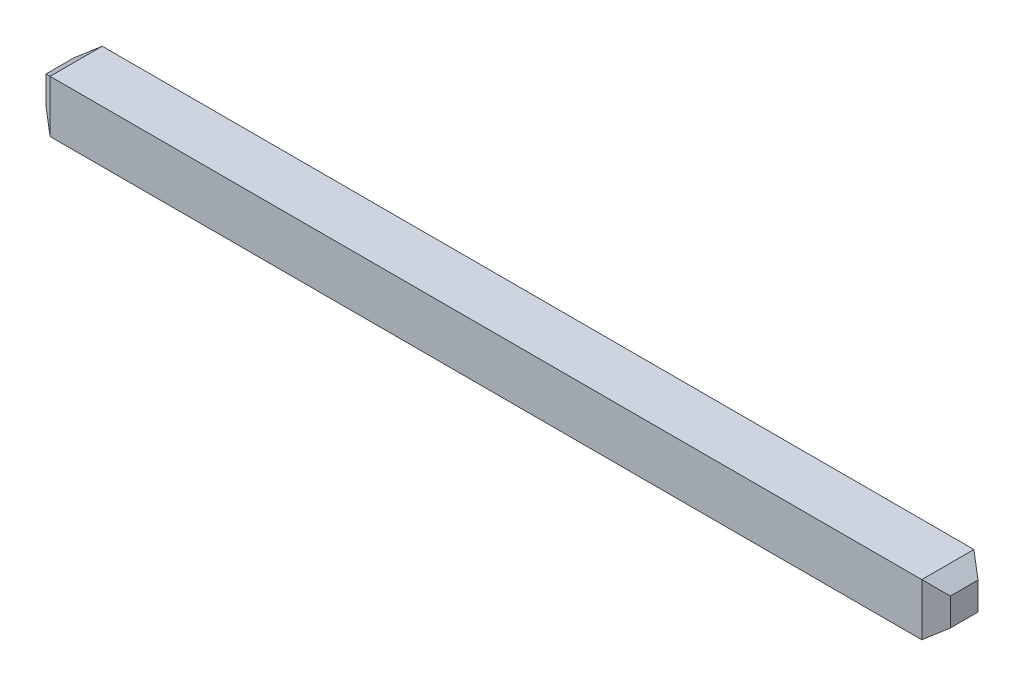
ISO-10303-21;
HEADER;
FILE_DESCRIPTION(('STEP AP214'),'2;1');
FILE_NAME('part.step','',(''),(''),'','','');
FILE_SCHEMA(('AUTOMOTIVE_DESIGN { 1 0 10303 214 1 1 1 1 }'));
ENDSEC;
DATA;
#1=APPLICATION_CONTEXT('core data for automotive mechanical design processes');
#2=APPLICATION_PROTOCOL_DEFINITION('international standard','automotive_design',2000,#1);
#3=PRODUCT_CONTEXT('',#1,'mechanical');
#4=PRODUCT('Part','Part','',(#3));
#5=PRODUCT_RELATED_PRODUCT_CATEGORY('part','',(#4));
#6=PRODUCT_DEFINITION_FORMATION('','',#4);
#7=PRODUCT_DEFINITION_CONTEXT('part definition',#1,'design');
#8=PRODUCT_DEFINITION('design','',#6,#7);
#9=PRODUCT_DEFINITION_SHAPE('','',#8);
#10=(LENGTH_UNIT() NAMED_UNIT(*) SI_UNIT(.MILLI.,.METRE.));
#11=(NAMED_UNIT(*) PLANE_ANGLE_UNIT() SI_UNIT($,.RADIAN.));
#12=(NAMED_UNIT(*) SI_UNIT($,.STERADIAN.) SOLID_ANGLE_UNIT());
#13=UNCERTAINTY_MEASURE_WITH_UNIT(LENGTH_MEASURE(1.E-05),#10,'distance_accuracy_value','');
#14=(GEOMETRIC_REPRESENTATION_CONTEXT(3) GLOBAL_UNCERTAINTY_ASSIGNED_CONTEXT((#13)) GLOBAL_UNIT_ASSIGNED_CONTEXT((#10,
#11,#12)) REPRESENTATION_CONTEXT('',''));
#15=CARTESIAN_POINT('',(0.,0.,0.));
#16=DIRECTION('',(0.,0.,1.));
#17=DIRECTION('',(1.,0.,0.));
#18=AXIS2_PLACEMENT_3D('',#15,#16,#17);
#19=CARTESIAN_POINT('',(-2.4,1.23,-11.675));
#20=DIRECTION('',(0.599999999990736,0.,0.800000000006948));
#21=DIRECTION('',(0.800000000006948,0.,-0.599999999990736));
#22=AXIS2_PLACEMENT_3D('',#19,#20,#21);
#23=PLANE('',#22);
#24=DIRECTION('',(0.,1.,0.));
#25=VECTOR('',#24,1.);
#26=CARTESIAN_POINT('',(-2.3,1.23,-11.75));
#27=LINE('',#26,#25);
#28=CARTESIAN_POINT('',(-2.29999999999957,1.55,-11.7499999999994));
#29=VERTEX_POINT('',#28);
#30=CARTESIAN_POINT('',(-2.29999999999958,0.909999999999898,-11.7499999999994));
#31=VERTEX_POINT('',#30);
#32=EDGE_CURVE('E101',#29,#31,#27,.F.);
#33=ORIENTED_EDGE('',*,*,#32,.T.);
#34=DIRECTION('',(-0.685994340569491,0.51449575542834,0.514495755427438));
#35=VECTOR('',#34,1.);
#36=CARTESIAN_POINT('',(-2.30000000000009,0.909999999999786,-11.75));
#37=LINE('',#36,#35);
#38=CARTESIAN_POINT('',(-2.50000000000021,1.06000000000001,-11.6000000000003));
#39=VERTEX_POINT('',#38);
#40=EDGE_CURVE('E85',#31,#39,#37,.T.);
#41=ORIENTED_EDGE('',*,*,#40,.T.);
#42=DIRECTION('',(0.,1.,0.));
#43=VECTOR('',#42,1.);
#44=CARTESIAN_POINT('',(-2.5,1.23,-11.6));
#45=LINE('',#44,#43);
#46=CARTESIAN_POINT('',(-2.50000000000044,1.4,-11.6000000000006));
#47=VERTEX_POINT('',#46);
#48=EDGE_CURVE('E79',#39,#47,#45,.T.);
#49=ORIENTED_EDGE('',*,*,#48,.T.);
#50=DIRECTION('',(-0.685994340570034,-0.514495755427526,0.514495755427528));
#51=VECTOR('',#50,1.);
#52=CARTESIAN_POINT('',(-2.3,1.55,-11.75));
#53=LINE('',#52,#51);
#54=EDGE_CURVE('E20',#29,#47,#53,.T.);
#55=ORIENTED_EDGE('',*,*,#54,.F.);
#56=EDGE_LOOP('',(#33,#41,#49,#55));
#57=FACE_BOUND('',#56,.T.);
#58=ADVANCED_FACE('F17',(#57),#23,.F.);
#59=CARTESIAN_POINT('',(8.5,1.23,-11.675));
#60=DIRECTION('',(-0.599999999990736,0.,0.800000000006948));
#61=DIRECTION('',(0.800000000006948,0.,0.599999999990736));
#62=AXIS2_PLACEMENT_3D('',#59,#60,#61);
#63=PLANE('',#62);
#64=DIRECTION('',(0.,1.,0.));
#65=VECTOR('',#64,1.);
#66=CARTESIAN_POINT('',(8.6,1.23,-11.6));
#67=LINE('',#66,#65);
#68=CARTESIAN_POINT('',(8.6000000000002,1.06000000000003,-11.6000000000003));
#69=VERTEX_POINT('',#68);
#70=CARTESIAN_POINT('',(8.60000000000043,1.4,-11.6000000000006));
#71=VERTEX_POINT('',#70);
#72=EDGE_CURVE('E113',#69,#71,#67,.T.);
#73=ORIENTED_EDGE('',*,*,#72,.F.);
#74=DIRECTION('',(-0.685994340569492,-0.51449575542834,-0.514495755427437));
#75=VECTOR('',#74,1.);
#76=CARTESIAN_POINT('',(8.59999999999996,1.06000000000005,-11.6));
#77=LINE('',#76,#75);
#78=CARTESIAN_POINT('',(8.39999999999959,0.909999999999884,-11.7499999999994));
#79=VERTEX_POINT('',#78);
#80=EDGE_CURVE('E108',#69,#79,#77,.T.);
#81=ORIENTED_EDGE('',*,*,#80,.T.);
#82=DIRECTION('',(0.,1.,0.));
#83=VECTOR('',#82,1.);
#84=CARTESIAN_POINT('',(8.4,1.23,-11.75));
#85=LINE('',#84,#83);
#86=CARTESIAN_POINT('',(8.39999999999957,1.55,-11.7499999999994));
#87=VERTEX_POINT('',#86);
#88=EDGE_CURVE('E99',#79,#87,#85,.T.);
#89=ORIENTED_EDGE('',*,*,#88,.T.);
#90=DIRECTION('',(-0.685994340570033,0.514495755427525,-0.514495755427531));
#91=VECTOR('',#90,1.);
#92=CARTESIAN_POINT('',(8.6,1.4,-11.6));
#93=LINE('',#92,#91);
#94=EDGE_CURVE('E116',#71,#87,#93,.T.);
#95=ORIENTED_EDGE('',*,*,#94,.F.);
#96=EDGE_LOOP('',(#73,#81,#89,#95));
#97=FACE_BOUND('',#96,.T.);
#98=ADVANCED_FACE('F214',(#97),#63,.F.);
#99=CARTESIAN_POINT('',(-2.4,1.475,-11.43));
#100=DIRECTION('',(-0.6,0.8,0.));
#101=DIRECTION('',(-0.8,-0.6,0.));
#102=AXIS2_PLACEMENT_3D('',#99,#100,#101);
#103=PLANE('',#102);
#104=DIRECTION('',(-0.685994340575993,-0.514495755427528,-0.514495755419581));
#105=VECTOR('',#104,1.);
#106=CARTESIAN_POINT('',(-2.29999999999913,1.55,-11.1100000000012));
#107=LINE('',#106,#105);
#108=CARTESIAN_POINT('',(-2.29999999999989,1.55,-11.1100000000001));
#109=VERTEX_POINT('',#108);
#110=CARTESIAN_POINT('',(-2.50000000000022,1.4,-11.2599999999997));
#111=VERTEX_POINT('',#110);
#112=EDGE_CURVE('E128',#109,#111,#107,.T.);
#113=ORIENTED_EDGE('',*,*,#112,.F.);
#114=DIRECTION('',(0.,0.,1.));
#115=VECTOR('',#114,1.);
#116=CARTESIAN_POINT('',(-2.3,1.55,-11.43));
#117=LINE('',#116,#115);
#118=EDGE_CURVE('E93',#29,#109,#117,.T.);
#119=ORIENTED_EDGE('',*,*,#118,.F.);
#120=ORIENTED_EDGE('',*,*,#54,.T.);
#121=DIRECTION('',(0.,0.,-1.));
#122=VECTOR('',#121,1.);
#123=CARTESIAN_POINT('',(-2.5,1.4,-11.43));
#124=LINE('',#123,#122);
#125=EDGE_CURVE('E87',#47,#111,#124,.F.);
#126=ORIENTED_EDGE('',*,*,#125,.T.);
#127=EDGE_LOOP('',(#113,#119,#120,#126));
#128=FACE_BOUND('',#127,.T.);
#129=ADVANCED_FACE('F90',(#128),#103,.T.);
#130=CARTESIAN_POINT('',(-2.5,1.23,-11.43));
#131=DIRECTION('',(1.,0.,0.));
#132=DIRECTION('',(0.,0.,-1.));
#133=AXIS2_PLACEMENT_3D('',#130,#131,#132);
#134=PLANE('',#133);
#135=DIRECTION('',(0.,1.,0.));
#136=VECTOR('',#135,1.);
#137=CARTESIAN_POINT('',(-2.50000000000087,1.23,-11.2599999999988));
#138=LINE('',#137,#136);
#139=CARTESIAN_POINT('',(-2.50000000000021,1.06000000000001,-11.2599999999997));
#140=VERTEX_POINT('',#139);
#141=EDGE_CURVE('E97',#111,#140,#138,.F.);
#142=ORIENTED_EDGE('',*,*,#141,.F.);
#143=ORIENTED_EDGE('',*,*,#125,.F.);
#144=ORIENTED_EDGE('',*,*,#48,.F.);
#145=DIRECTION('',(0.,0.,1.));
#146=VECTOR('',#145,1.);
#147=CARTESIAN_POINT('',(-2.49999999999996,1.06000000000005,-11.43));
#148=LINE('',#147,#146);
#149=EDGE_CURVE('E105',#39,#140,#148,.T.);
#150=ORIENTED_EDGE('',*,*,#149,.T.);
#151=EDGE_LOOP('',(#142,#143,#144,#150));
#152=FACE_BOUND('',#151,.T.);
#153=ADVANCED_FACE('F95',(#152),#134,.F.);
#154=CARTESIAN_POINT('',(3.05,1.23,-11.75));
#155=DIRECTION('',(0.,0.,1.));
#156=DIRECTION('',(1.,0.,0.));
#157=AXIS2_PLACEMENT_3D('',#154,#155,#156);
#158=PLANE('',#157);
#159=ORIENTED_EDGE('',*,*,#32,.F.);
#160=DIRECTION('',(1.,0.,0.));
#161=VECTOR('',#160,1.);
#162=CARTESIAN_POINT('',(3.05,1.55,-11.75));
#163=LINE('',#162,#161);
#164=EDGE_CURVE('E122',#87,#29,#163,.F.);
#165=ORIENTED_EDGE('',*,*,#164,.F.);
#166=ORIENTED_EDGE('',*,*,#88,.F.);
#167=DIRECTION('',(1.,0.,0.));
#168=VECTOR('',#167,1.);
#169=CARTESIAN_POINT('',(3.05,0.91,-11.75));
#170=LINE('',#169,#168);
#171=EDGE_CURVE('E136',#79,#31,#170,.F.);
#172=ORIENTED_EDGE('',*,*,#171,.T.);
#173=EDGE_LOOP('',(#159,#165,#166,#172));
#174=FACE_BOUND('',#173,.T.);
#175=ADVANCED_FACE('F182',(#174),#158,.F.);
#176=CARTESIAN_POINT('',(-2.4,0.9849999999999,-11.43));
#177=DIRECTION('',(0.600000000000912,0.799999999999316,0.));
#178=DIRECTION('',(-0.799999999999316,0.600000000000912,0.));
#179=AXIS2_PLACEMENT_3D('',#176,#177,#178);
#180=PLANE('',#179);
#181=DIRECTION('',(0.,0.,1.));
#182=VECTOR('',#181,1.);
#183=CARTESIAN_POINT('',(-2.3,0.91,-11.43));
#184=LINE('',#183,#182);
#185=CARTESIAN_POINT('',(-2.29999999999983,0.909999999999856,-11.1100000000003));
#186=VERTEX_POINT('',#185);
#187=EDGE_CURVE('E139',#31,#186,#184,.T.);
#188=ORIENTED_EDGE('',*,*,#187,.T.);
#189=DIRECTION('',(0.685994340575872,-0.514495755427781,0.51449575541949));
#190=VECTOR('',#189,1.);
#191=CARTESIAN_POINT('',(-2.50000000000087,1.06,-11.2599999999988));
#192=LINE('',#191,#190);
#193=EDGE_CURVE('E131',#140,#186,#192,.T.);
#194=ORIENTED_EDGE('',*,*,#193,.F.);
#195=ORIENTED_EDGE('',*,*,#149,.F.);
#196=ORIENTED_EDGE('',*,*,#40,.F.);
#197=EDGE_LOOP('',(#188,#194,#195,#196));
#198=FACE_BOUND('',#197,.T.);
#199=ADVANCED_FACE('F179',(#198),#180,.F.);
#200=CARTESIAN_POINT('',(8.5,0.9849999999999,-11.43));
#201=DIRECTION('',(-0.600000000000912,0.799999999999316,0.));
#202=DIRECTION('',(-0.799999999999316,-0.600000000000912,0.));
#203=AXIS2_PLACEMENT_3D('',#200,#201,#202);
#204=PLANE('',#203);
#205=DIRECTION('',(0.,0.,-1.));
#206=VECTOR('',#205,1.);
#207=CARTESIAN_POINT('',(8.6,1.06,-11.43));
#208=LINE('',#207,#206);
#209=CARTESIAN_POINT('',(8.6000000000002,1.06000000000003,-11.2599999999997));
#210=VERTEX_POINT('',#209);
#211=EDGE_CURVE('E110',#210,#69,#208,.T.);
#212=ORIENTED_EDGE('',*,*,#211,.F.);
#213=DIRECTION('',(0.68599434057587,0.514495755427782,-0.514495755419492));
#214=VECTOR('',#213,1.);
#215=CARTESIAN_POINT('',(8.39999999999913,0.9099999999999,-11.1100000000012));
#216=LINE('',#215,#214);
#217=CARTESIAN_POINT('',(8.39999999999993,0.909999999999868,-11.1100000000001));
#218=VERTEX_POINT('',#217);
#219=EDGE_CURVE('E35',#218,#210,#216,.T.);
#220=ORIENTED_EDGE('',*,*,#219,.F.);
#221=DIRECTION('',(0.,0.,1.));
#222=VECTOR('',#221,1.);
#223=CARTESIAN_POINT('',(8.4,0.91,-11.43));
#224=LINE('',#223,#222);
#225=EDGE_CURVE('E134',#218,#79,#224,.F.);
#226=ORIENTED_EDGE('',*,*,#225,.T.);
#227=ORIENTED_EDGE('',*,*,#80,.F.);
#228=EDGE_LOOP('',(#212,#220,#226,#227));
#229=FACE_BOUND('',#228,.T.);
#230=ADVANCED_FACE('F181',(#229),#204,.F.);
#231=CARTESIAN_POINT('',(8.6,1.23,-11.43));
#232=DIRECTION('',(1.,0.,0.));
#233=DIRECTION('',(0.,0.,-1.));
#234=AXIS2_PLACEMENT_3D('',#231,#232,#233);
#235=PLANE('',#234);
#236=ORIENTED_EDGE('',*,*,#72,.T.);
#237=DIRECTION('',(0.,0.,1.));
#238=VECTOR('',#237,1.);
#239=CARTESIAN_POINT('',(8.6,1.4,-11.43));
#240=LINE('',#239,#238);
#241=CARTESIAN_POINT('',(8.60000000000022,1.4,-11.2599999999997));
#242=VERTEX_POINT('',#241);
#243=EDGE_CURVE('E119',#242,#71,#240,.F.);
#244=ORIENTED_EDGE('',*,*,#243,.F.);
#245=DIRECTION('',(0.,1.,0.));
#246=VECTOR('',#245,1.);
#247=CARTESIAN_POINT('',(8.60000000000087,1.23,-11.2599999999988));
#248=LINE('',#247,#246);
#249=EDGE_CURVE('E142',#210,#242,#248,.T.);
#250=ORIENTED_EDGE('',*,*,#249,.F.);
#251=ORIENTED_EDGE('',*,*,#211,.T.);
#252=EDGE_LOOP('',(#236,#244,#250,#251));
#253=FACE_BOUND('',#252,.T.);
#254=ADVANCED_FACE('F189',(#253),#235,.T.);
#255=CARTESIAN_POINT('',(8.5,1.475,-11.43));
#256=DIRECTION('',(0.6,0.8,0.));
#257=DIRECTION('',(-0.8,0.6,0.));
#258=AXIS2_PLACEMENT_3D('',#255,#256,#257);
#259=PLANE('',#258);
#260=DIRECTION('',(-0.685994340575991,0.51449575542753,0.514495755419583));
#261=VECTOR('',#260,1.);
#262=CARTESIAN_POINT('',(8.60000000000087,1.4,-11.2599999999988));
#263=LINE('',#262,#261);
#264=CARTESIAN_POINT('',(8.39999999999989,1.55,-11.1100000000001));
#265=VERTEX_POINT('',#264);
#266=EDGE_CURVE('E145',#242,#265,#263,.T.);
#267=ORIENTED_EDGE('',*,*,#266,.F.);
#268=ORIENTED_EDGE('',*,*,#243,.T.);
#269=ORIENTED_EDGE('',*,*,#94,.T.);
#270=DIRECTION('',(0.,0.,1.));
#271=VECTOR('',#270,1.);
#272=CARTESIAN_POINT('',(8.4,1.55,-11.43));
#273=LINE('',#272,#271);
#274=EDGE_CURVE('E125',#265,#87,#273,.F.);
#275=ORIENTED_EDGE('',*,*,#274,.F.);
#276=EDGE_LOOP('',(#267,#268,#269,#275));
#277=FACE_BOUND('',#276,.T.);
#278=ADVANCED_FACE('F170',(#277),#259,.T.);
#279=CARTESIAN_POINT('',(3.05,1.55,-11.43));
#280=DIRECTION('',(0.,1.,0.));
#281=DIRECTION('',(0.,0.,1.));
#282=AXIS2_PLACEMENT_3D('',#279,#280,#281);
#283=PLANE('',#282);
#284=DIRECTION('',(1.,0.,0.));
#285=VECTOR('',#284,1.);
#286=CARTESIAN_POINT('',(3.05,1.55,-11.11));
#287=LINE('',#286,#285);
#288=EDGE_CURVE('E148',#265,#109,#287,.F.);
#289=ORIENTED_EDGE('',*,*,#288,.F.);
#290=ORIENTED_EDGE('',*,*,#274,.T.);
#291=ORIENTED_EDGE('',*,*,#164,.T.);
#292=ORIENTED_EDGE('',*,*,#118,.T.);
#293=EDGE_LOOP('',(#289,#290,#291,#292));
#294=FACE_BOUND('',#293,.T.);
#295=ADVANCED_FACE('F173',(#294),#283,.T.);
#296=CARTESIAN_POINT('',(-2.4,1.23,-11.185));
#297=DIRECTION('',(-0.599999999990736,0.,0.800000000006948));
#298=DIRECTION('',(0.800000000006948,0.,0.599999999990736));
#299=AXIS2_PLACEMENT_3D('',#296,#297,#298);
#300=PLANE('',#299);
#301=ORIENTED_EDGE('',*,*,#193,.T.);
#302=DIRECTION('',(0.,1.,0.));
#303=VECTOR('',#302,1.);
#304=CARTESIAN_POINT('',(-2.3,1.23,-11.11));
#305=LINE('',#304,#303);
#306=EDGE_CURVE('E151',#109,#186,#305,.F.);
#307=ORIENTED_EDGE('',*,*,#306,.F.);
#308=ORIENTED_EDGE('',*,*,#112,.T.);
#309=ORIENTED_EDGE('',*,*,#141,.T.);
#310=EDGE_LOOP('',(#301,#307,#308,#309));
#311=FACE_BOUND('',#310,.T.);
#312=ADVANCED_FACE('F176',(#311),#300,.T.);
#313=CARTESIAN_POINT('',(3.05,0.91,-11.43));
#314=DIRECTION('',(0.,1.,0.));
#315=DIRECTION('',(0.,0.,1.));
#316=AXIS2_PLACEMENT_3D('',#313,#314,#315);
#317=PLANE('',#316);
#318=ORIENTED_EDGE('',*,*,#187,.F.);
#319=ORIENTED_EDGE('',*,*,#171,.F.);
#320=ORIENTED_EDGE('',*,*,#225,.F.);
#321=DIRECTION('',(1.,0.,0.));
#322=VECTOR('',#321,1.);
#323=CARTESIAN_POINT('',(3.05,0.9099999999999,-11.11));
#324=LINE('',#323,#322);
#325=EDGE_CURVE('E26',#186,#218,#324,.T.);
#326=ORIENTED_EDGE('',*,*,#325,.F.);
#327=EDGE_LOOP('',(#318,#319,#320,#326));
#328=FACE_BOUND('',#327,.T.);
#329=ADVANCED_FACE('F162',(#328),#317,.F.);
#330=CARTESIAN_POINT('',(8.5,1.23,-11.185));
#331=DIRECTION('',(0.599999999990736,0.,0.800000000006948));
#332=DIRECTION('',(0.800000000006948,0.,-0.599999999990736));
#333=AXIS2_PLACEMENT_3D('',#330,#331,#332);
#334=PLANE('',#333);
#335=ORIENTED_EDGE('',*,*,#266,.T.);
#336=DIRECTION('',(0.,1.,0.));
#337=VECTOR('',#336,1.);
#338=CARTESIAN_POINT('',(8.4,1.23,-11.11));
#339=LINE('',#338,#337);
#340=EDGE_CURVE('E11',#218,#265,#339,.T.);
#341=ORIENTED_EDGE('',*,*,#340,.F.);
#342=ORIENTED_EDGE('',*,*,#219,.T.);
#343=ORIENTED_EDGE('',*,*,#249,.T.);
#344=EDGE_LOOP('',(#335,#341,#342,#343));
#345=FACE_BOUND('',#344,.T.);
#346=ADVANCED_FACE('F166',(#345),#334,.T.);
#347=CARTESIAN_POINT('',(3.05,1.23,-11.11));
#348=DIRECTION('',(0.,0.,1.));
#349=DIRECTION('',(1.,0.,0.));
#350=AXIS2_PLACEMENT_3D('',#347,#348,#349);
#351=PLANE('',#350);
#352=ORIENTED_EDGE('',*,*,#325,.T.);
#353=ORIENTED_EDGE('',*,*,#340,.T.);
#354=ORIENTED_EDGE('',*,*,#288,.T.);
#355=ORIENTED_EDGE('',*,*,#306,.T.);
#356=EDGE_LOOP('',(#352,#353,#354,#355));
#357=FACE_BOUND('',#356,.T.);
#358=ADVANCED_FACE('F157',(#357),#351,.T.);
#359=CLOSED_SHELL('',(#58,#98,#129,#153,#175,#199,#230,#254,#278,#295,#312,#329,#346,#358));
#360=MANIFOLD_SOLID_BREP('B1',#359);
#361=ADVANCED_BREP_SHAPE_REPRESENTATION('',(#18,#360),#14);
#362=SHAPE_DEFINITION_REPRESENTATION(#9,#361);
ENDSEC;
END-ISO-10303-21;
